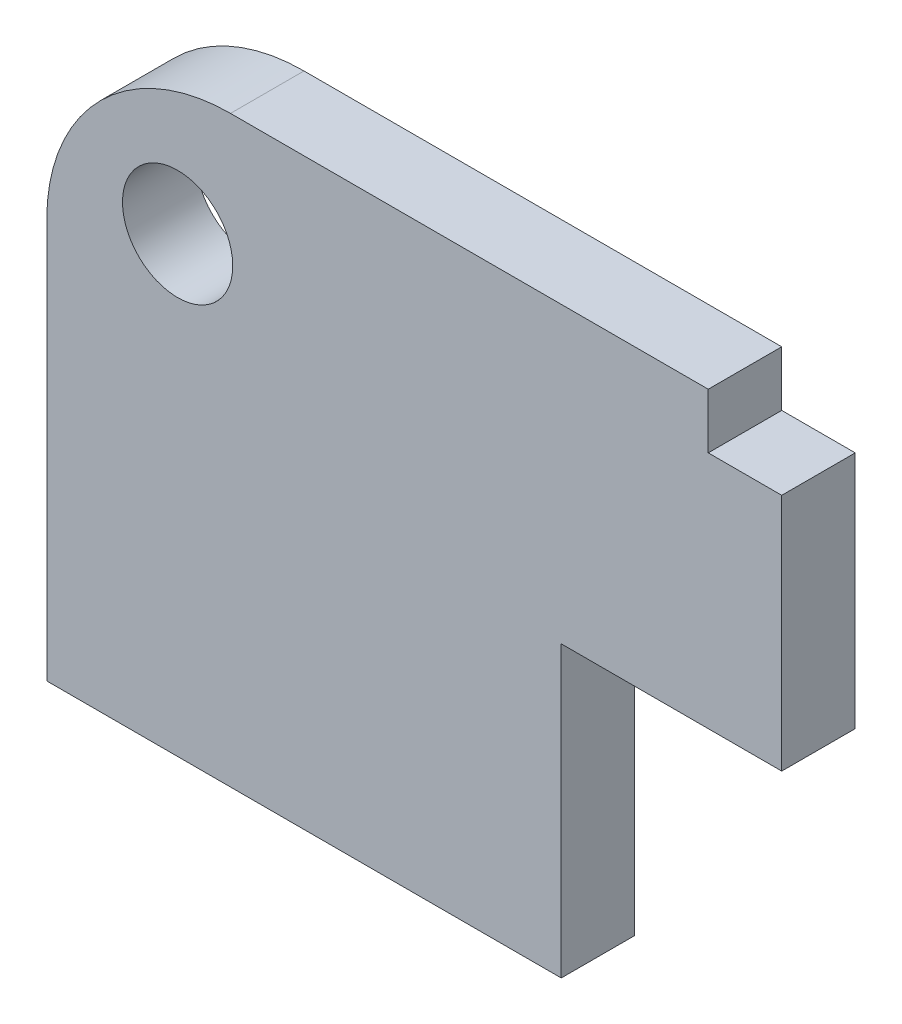
ISO-10303-21;
HEADER;
FILE_DESCRIPTION(('STEP AP214'),'2;1');
FILE_NAME('part.step','',(''),(''),'','','');
FILE_SCHEMA(('AUTOMOTIVE_DESIGN { 1 0 10303 214 1 1 1 1 }'));
ENDSEC;
DATA;
#1=APPLICATION_CONTEXT('core data for automotive mechanical design processes');
#2=APPLICATION_PROTOCOL_DEFINITION('international standard','automotive_design',2000,#1);
#3=PRODUCT_CONTEXT('',#1,'mechanical');
#4=PRODUCT('Part','Part','',(#3));
#5=PRODUCT_RELATED_PRODUCT_CATEGORY('part','',(#4));
#6=PRODUCT_DEFINITION_FORMATION('','',#4);
#7=PRODUCT_DEFINITION_CONTEXT('part definition',#1,'design');
#8=PRODUCT_DEFINITION('design','',#6,#7);
#9=PRODUCT_DEFINITION_SHAPE('','',#8);
#10=(LENGTH_UNIT() NAMED_UNIT(*) SI_UNIT(.MILLI.,.METRE.));
#11=(NAMED_UNIT(*) PLANE_ANGLE_UNIT() SI_UNIT($,.RADIAN.));
#12=(NAMED_UNIT(*) SI_UNIT($,.STERADIAN.) SOLID_ANGLE_UNIT());
#13=UNCERTAINTY_MEASURE_WITH_UNIT(LENGTH_MEASURE(1.E-05),#10,'distance_accuracy_value','');
#14=(GEOMETRIC_REPRESENTATION_CONTEXT(3) GLOBAL_UNCERTAINTY_ASSIGNED_CONTEXT((#13)) GLOBAL_UNIT_ASSIGNED_CONTEXT((#10,
#11,#12)) REPRESENTATION_CONTEXT('',''));
#15=CARTESIAN_POINT('',(0.,0.,0.));
#16=DIRECTION('',(0.,0.,1.));
#17=DIRECTION('',(1.,0.,0.));
#18=AXIS2_PLACEMENT_3D('',#15,#16,#17);
#19=CARTESIAN_POINT('',(5.,-5.,2.));
#20=DIRECTION('',(0.,0.,-1.));
#21=DIRECTION('',(-1.,0.,0.));
#22=AXIS2_PLACEMENT_3D('',#19,#20,#21);
#23=PLANE('',#22);
#24=CARTESIAN_POINT('',(5.,-5.,2.));
#25=DIRECTION('',(0.,0.,1.));
#26=DIRECTION('',(-1.,0.,0.));
#27=AXIS2_PLACEMENT_3D('',#24,#25,#26);
#28=CIRCLE('',#27,5.);
#29=CARTESIAN_POINT('',(5.00000000000004,0.,2.));
#30=VERTEX_POINT('',#29);
#31=CARTESIAN_POINT('',(0.,-5.00000000000004,2.));
#32=VERTEX_POINT('',#31);
#33=EDGE_CURVE('E153',#30,#32,#28,.T.);
#34=ORIENTED_EDGE('',*,*,#33,.T.);
#35=DIRECTION('',(0.,-1.,0.));
#36=VECTOR('',#35,1.);
#37=CARTESIAN_POINT('',(0.,-15.8756265982005,2.));
#38=LINE('',#37,#36);
#39=CARTESIAN_POINT('',(0.,-15.8756265982005,2.));
#40=VERTEX_POINT('',#39);
#41=EDGE_CURVE('E96',#32,#40,#38,.T.);
#42=ORIENTED_EDGE('',*,*,#41,.T.);
#43=DIRECTION('',(1.,0.,0.));
#44=VECTOR('',#43,1.);
#45=CARTESIAN_POINT('',(14.,-15.8756265982005,2.));
#46=LINE('',#45,#44);
#47=CARTESIAN_POINT('',(14.,-15.8756265982005,2.));
#48=VERTEX_POINT('',#47);
#49=EDGE_CURVE('E171',#40,#48,#46,.T.);
#50=ORIENTED_EDGE('',*,*,#49,.T.);
#51=DIRECTION('',(0.,1.,0.));
#52=VECTOR('',#51,1.);
#53=CARTESIAN_POINT('',(14.,-15.8756265982005,2.));
#54=LINE('',#53,#52);
#55=CARTESIAN_POINT('',(14.,-7.99999999999997,2.));
#56=VERTEX_POINT('',#55);
#57=EDGE_CURVE('E188',#48,#56,#54,.T.);
#58=ORIENTED_EDGE('',*,*,#57,.T.);
#59=DIRECTION('',(1.,0.,0.));
#60=VECTOR('',#59,1.);
#61=CARTESIAN_POINT('',(14.,-7.99999999999997,2.));
#62=LINE('',#61,#60);
#63=CARTESIAN_POINT('',(20.,-7.99999999999997,2.));
#64=VERTEX_POINT('',#63);
#65=EDGE_CURVE('E187',#56,#64,#62,.T.);
#66=ORIENTED_EDGE('',*,*,#65,.T.);
#67=DIRECTION('',(0.,1.,0.));
#68=VECTOR('',#67,1.);
#69=CARTESIAN_POINT('',(20.,-1.49999999999998,2.));
#70=LINE('',#69,#68);
#71=CARTESIAN_POINT('',(20.,-1.49999999999998,2.));
#72=VERTEX_POINT('',#71);
#73=EDGE_CURVE('E118',#64,#72,#70,.T.);
#74=ORIENTED_EDGE('',*,*,#73,.T.);
#75=DIRECTION('',(-1.,0.,0.));
#76=VECTOR('',#75,1.);
#77=CARTESIAN_POINT('',(20.,-1.49999999999998,2.));
#78=LINE('',#77,#76);
#79=CARTESIAN_POINT('',(18.,-1.49999999999998,2.));
#80=VERTEX_POINT('',#79);
#81=EDGE_CURVE('E112',#72,#80,#78,.T.);
#82=ORIENTED_EDGE('',*,*,#81,.T.);
#83=DIRECTION('',(0.,1.,0.));
#84=VECTOR('',#83,1.);
#85=CARTESIAN_POINT('',(18.,-1.49999999999998,2.));
#86=LINE('',#85,#84);
#87=CARTESIAN_POINT('',(18.,0.,2.));
#88=VERTEX_POINT('',#87);
#89=EDGE_CURVE('E116',#80,#88,#86,.T.);
#90=ORIENTED_EDGE('',*,*,#89,.T.);
#91=DIRECTION('',(-1.,0.,0.));
#92=VECTOR('',#91,1.);
#93=CARTESIAN_POINT('',(5.00000000000004,0.,2.));
#94=LINE('',#93,#92);
#95=EDGE_CURVE('E50',#88,#30,#94,.T.);
#96=ORIENTED_EDGE('',*,*,#95,.T.);
#97=EDGE_LOOP('',(#34,#42,#50,#58,#66,#74,#82,#90,#96));
#98=FACE_BOUND('',#97,.T.);
#99=CARTESIAN_POINT('',(3.56066017177984,-3.56066017177984,2.));
#100=DIRECTION('',(0.,0.,1.));
#101=DIRECTION('',(1.,0.,0.));
#102=AXIS2_PLACEMENT_3D('',#99,#100,#101);
#103=CIRCLE('',#102,1.5);
#104=CARTESIAN_POINT('',(5.06066017177984,-3.56066017177984,2.));
#105=VERTEX_POINT('',#104);
#106=EDGE_CURVE('E140',#105,#105,#103,.T.);
#107=ORIENTED_EDGE('',*,*,#106,.F.);
#108=EDGE_LOOP('',(#107));
#109=FACE_BOUND('',#108,.T.);
#110=ADVANCED_FACE('F33',(#98,#109),#23,.F.);
#111=CARTESIAN_POINT('',(5.,-5.,0.));
#112=DIRECTION('',(0.,0.,-1.));
#113=DIRECTION('',(-1.,0.,0.));
#114=AXIS2_PLACEMENT_3D('',#111,#112,#113);
#115=PLANE('',#114);
#116=CARTESIAN_POINT('',(5.,-5.,0.));
#117=DIRECTION('',(0.,0.,1.));
#118=DIRECTION('',(-1.,0.,0.));
#119=AXIS2_PLACEMENT_3D('',#116,#117,#118);
#120=CIRCLE('',#119,5.);
#121=CARTESIAN_POINT('',(5.00000000000004,0.,0.));
#122=VERTEX_POINT('',#121);
#123=CARTESIAN_POINT('',(0.,-5.00000000000004,0.));
#124=VERTEX_POINT('',#123);
#125=EDGE_CURVE('E136',#122,#124,#120,.T.);
#126=ORIENTED_EDGE('',*,*,#125,.F.);
#127=DIRECTION('',(-1.,0.,0.));
#128=VECTOR('',#127,1.);
#129=CARTESIAN_POINT('',(5.00000000000004,0.,0.));
#130=LINE('',#129,#128);
#131=CARTESIAN_POINT('',(18.,0.,0.));
#132=VERTEX_POINT('',#131);
#133=EDGE_CURVE('E88',#132,#122,#130,.T.);
#134=ORIENTED_EDGE('',*,*,#133,.F.);
#135=DIRECTION('',(0.,1.,0.));
#136=VECTOR('',#135,1.);
#137=CARTESIAN_POINT('',(18.,-1.49999999999998,0.));
#138=LINE('',#137,#136);
#139=CARTESIAN_POINT('',(18.,-1.49999999999998,0.));
#140=VERTEX_POINT('',#139);
#141=EDGE_CURVE('E82',#140,#132,#138,.T.);
#142=ORIENTED_EDGE('',*,*,#141,.F.);
#143=DIRECTION('',(-1.,0.,0.));
#144=VECTOR('',#143,1.);
#145=CARTESIAN_POINT('',(20.,-1.49999999999998,0.));
#146=LINE('',#145,#144);
#147=CARTESIAN_POINT('',(20.,-1.49999999999998,0.));
#148=VERTEX_POINT('',#147);
#149=EDGE_CURVE('E126',#148,#140,#146,.T.);
#150=ORIENTED_EDGE('',*,*,#149,.F.);
#151=DIRECTION('',(0.,1.,0.));
#152=VECTOR('',#151,1.);
#153=CARTESIAN_POINT('',(20.,-1.49999999999998,0.));
#154=LINE('',#153,#152);
#155=CARTESIAN_POINT('',(20.,-7.99999999999997,0.));
#156=VERTEX_POINT('',#155);
#157=EDGE_CURVE('E148',#156,#148,#154,.T.);
#158=ORIENTED_EDGE('',*,*,#157,.F.);
#159=DIRECTION('',(1.,0.,0.));
#160=VECTOR('',#159,1.);
#161=CARTESIAN_POINT('',(14.,-7.99999999999997,0.));
#162=LINE('',#161,#160);
#163=CARTESIAN_POINT('',(14.,-7.99999999999997,0.));
#164=VERTEX_POINT('',#163);
#165=EDGE_CURVE('E146',#164,#156,#162,.T.);
#166=ORIENTED_EDGE('',*,*,#165,.F.);
#167=DIRECTION('',(0.,1.,0.));
#168=VECTOR('',#167,1.);
#169=CARTESIAN_POINT('',(14.,-15.8756265982005,0.));
#170=LINE('',#169,#168);
#171=CARTESIAN_POINT('',(14.,-15.8756265982005,0.));
#172=VERTEX_POINT('',#171);
#173=EDGE_CURVE('E144',#172,#164,#170,.T.);
#174=ORIENTED_EDGE('',*,*,#173,.F.);
#175=DIRECTION('',(1.,0.,0.));
#176=VECTOR('',#175,1.);
#177=CARTESIAN_POINT('',(14.,-15.8756265982005,0.));
#178=LINE('',#177,#176);
#179=CARTESIAN_POINT('',(0.,-15.8756265982005,0.));
#180=VERTEX_POINT('',#179);
#181=EDGE_CURVE('E142',#180,#172,#178,.T.);
#182=ORIENTED_EDGE('',*,*,#181,.F.);
#183=DIRECTION('',(0.,-1.,0.));
#184=VECTOR('',#183,1.);
#185=CARTESIAN_POINT('',(0.,-15.8756265982005,0.));
#186=LINE('',#185,#184);
#187=EDGE_CURVE('E139',#124,#180,#186,.T.);
#188=ORIENTED_EDGE('',*,*,#187,.F.);
#189=EDGE_LOOP('',(#126,#134,#142,#150,#158,#166,#174,#182,#188));
#190=FACE_BOUND('',#189,.T.);
#191=CARTESIAN_POINT('',(3.56066017177984,-3.56066017177984,0.));
#192=DIRECTION('',(0.,0.,1.));
#193=DIRECTION('',(1.,0.,0.));
#194=AXIS2_PLACEMENT_3D('',#191,#192,#193);
#195=CIRCLE('',#194,1.5);
#196=CARTESIAN_POINT('',(5.06066017177984,-3.56066017177984,0.));
#197=VERTEX_POINT('',#196);
#198=EDGE_CURVE('E195',#197,#197,#195,.T.);
#199=ORIENTED_EDGE('',*,*,#198,.T.);
#200=EDGE_LOOP('',(#199));
#201=FACE_BOUND('',#200,.T.);
#202=ADVANCED_FACE('F175',(#190,#201),#115,.T.);
#203=CARTESIAN_POINT('',(5.,-5.,2.));
#204=DIRECTION('',(0.,0.,-1.));
#205=DIRECTION('',(-1.,0.,0.));
#206=AXIS2_PLACEMENT_3D('',#203,#204,#205);
#207=CYLINDRICAL_SURFACE('',#206,5.);
#208=ORIENTED_EDGE('',*,*,#125,.T.);
#209=DIRECTION('',(0.,0.,-1.));
#210=VECTOR('',#209,1.);
#211=CARTESIAN_POINT('',(0.,-5.00000000000004,2.));
#212=LINE('',#211,#210);
#213=EDGE_CURVE('E11',#32,#124,#212,.T.);
#214=ORIENTED_EDGE('',*,*,#213,.F.);
#215=ORIENTED_EDGE('',*,*,#33,.F.);
#216=DIRECTION('',(0.,0.,-1.));
#217=VECTOR('',#216,1.);
#218=CARTESIAN_POINT('',(5.00000000000004,0.,2.));
#219=LINE('',#218,#217);
#220=EDGE_CURVE('E132',#30,#122,#219,.T.);
#221=ORIENTED_EDGE('',*,*,#220,.T.);
#222=EDGE_LOOP('',(#208,#214,#215,#221));
#223=FACE_BOUND('',#222,.T.);
#224=ADVANCED_FACE('F35',(#223),#207,.T.);
#225=CARTESIAN_POINT('',(0.,-15.8756265982005,2.));
#226=DIRECTION('',(1.,0.,0.));
#227=DIRECTION('',(0.,0.,-1.));
#228=AXIS2_PLACEMENT_3D('',#225,#226,#227);
#229=PLANE('',#228);
#230=ORIENTED_EDGE('',*,*,#187,.T.);
#231=DIRECTION('',(0.,0.,-1.));
#232=VECTOR('',#231,1.);
#233=CARTESIAN_POINT('',(0.,-15.8756265982005,2.));
#234=LINE('',#233,#232);
#235=EDGE_CURVE('E42',#40,#180,#234,.T.);
#236=ORIENTED_EDGE('',*,*,#235,.F.);
#237=ORIENTED_EDGE('',*,*,#41,.F.);
#238=ORIENTED_EDGE('',*,*,#213,.T.);
#239=EDGE_LOOP('',(#230,#236,#237,#238));
#240=FACE_BOUND('',#239,.T.);
#241=ADVANCED_FACE('F227',(#240),#229,.F.);
#242=CARTESIAN_POINT('',(14.,-15.8756265982005,2.));
#243=DIRECTION('',(0.,1.,0.));
#244=DIRECTION('',(0.,0.,1.));
#245=AXIS2_PLACEMENT_3D('',#242,#243,#244);
#246=PLANE('',#245);
#247=ORIENTED_EDGE('',*,*,#181,.T.);
#248=DIRECTION('',(0.,0.,-1.));
#249=VECTOR('',#248,1.);
#250=CARTESIAN_POINT('',(14.,-15.8756265982005,2.));
#251=LINE('',#250,#249);
#252=EDGE_CURVE('E163',#48,#172,#251,.T.);
#253=ORIENTED_EDGE('',*,*,#252,.F.);
#254=ORIENTED_EDGE('',*,*,#49,.F.);
#255=ORIENTED_EDGE('',*,*,#235,.T.);
#256=EDGE_LOOP('',(#247,#253,#254,#255));
#257=FACE_BOUND('',#256,.T.);
#258=ADVANCED_FACE('F169',(#257),#246,.F.);
#259=CARTESIAN_POINT('',(14.,-15.8756265982005,2.));
#260=DIRECTION('',(-1.,0.,0.));
#261=DIRECTION('',(0.,0.,1.));
#262=AXIS2_PLACEMENT_3D('',#259,#260,#261);
#263=PLANE('',#262);
#264=ORIENTED_EDGE('',*,*,#173,.T.);
#265=DIRECTION('',(0.,0.,-1.));
#266=VECTOR('',#265,1.);
#267=CARTESIAN_POINT('',(14.,-7.99999999999997,2.));
#268=LINE('',#267,#266);
#269=EDGE_CURVE('E160',#56,#164,#268,.T.);
#270=ORIENTED_EDGE('',*,*,#269,.F.);
#271=ORIENTED_EDGE('',*,*,#57,.F.);
#272=ORIENTED_EDGE('',*,*,#252,.T.);
#273=EDGE_LOOP('',(#264,#270,#271,#272));
#274=FACE_BOUND('',#273,.T.);
#275=ADVANCED_FACE('F181',(#274),#263,.F.);
#276=CARTESIAN_POINT('',(14.,-7.99999999999997,2.));
#277=DIRECTION('',(0.,1.,0.));
#278=DIRECTION('',(0.,0.,1.));
#279=AXIS2_PLACEMENT_3D('',#276,#277,#278);
#280=PLANE('',#279);
#281=ORIENTED_EDGE('',*,*,#165,.T.);
#282=DIRECTION('',(0.,0.,-1.));
#283=VECTOR('',#282,1.);
#284=CARTESIAN_POINT('',(20.,-7.99999999999997,2.));
#285=LINE('',#284,#283);
#286=EDGE_CURVE('E157',#64,#156,#285,.T.);
#287=ORIENTED_EDGE('',*,*,#286,.F.);
#288=ORIENTED_EDGE('',*,*,#65,.F.);
#289=ORIENTED_EDGE('',*,*,#269,.T.);
#290=EDGE_LOOP('',(#281,#287,#288,#289));
#291=FACE_BOUND('',#290,.T.);
#292=ADVANCED_FACE('F185',(#291),#280,.F.);
#293=CARTESIAN_POINT('',(20.,-1.49999999999998,2.));
#294=DIRECTION('',(-1.,0.,0.));
#295=DIRECTION('',(0.,0.,1.));
#296=AXIS2_PLACEMENT_3D('',#293,#294,#295);
#297=PLANE('',#296);
#298=ORIENTED_EDGE('',*,*,#157,.T.);
#299=DIRECTION('',(0.,0.,-1.));
#300=VECTOR('',#299,1.);
#301=CARTESIAN_POINT('',(20.,-1.49999999999998,2.));
#302=LINE('',#301,#300);
#303=EDGE_CURVE('E127',#72,#148,#302,.T.);
#304=ORIENTED_EDGE('',*,*,#303,.F.);
#305=ORIENTED_EDGE('',*,*,#73,.F.);
#306=ORIENTED_EDGE('',*,*,#286,.T.);
#307=EDGE_LOOP('',(#298,#304,#305,#306));
#308=FACE_BOUND('',#307,.T.);
#309=ADVANCED_FACE('F218',(#308),#297,.F.);
#310=CARTESIAN_POINT('',(20.,-1.49999999999998,2.));
#311=DIRECTION('',(0.,-1.,0.));
#312=DIRECTION('',(1.,0.,0.));
#313=AXIS2_PLACEMENT_3D('',#310,#311,#312);
#314=PLANE('',#313);
#315=ORIENTED_EDGE('',*,*,#149,.T.);
#316=DIRECTION('',(0.,0.,-1.));
#317=VECTOR('',#316,1.);
#318=CARTESIAN_POINT('',(18.,-1.49999999999998,2.));
#319=LINE('',#318,#317);
#320=EDGE_CURVE('E123',#80,#140,#319,.T.);
#321=ORIENTED_EDGE('',*,*,#320,.F.);
#322=ORIENTED_EDGE('',*,*,#81,.F.);
#323=ORIENTED_EDGE('',*,*,#303,.T.);
#324=EDGE_LOOP('',(#315,#321,#322,#323));
#325=FACE_BOUND('',#324,.T.);
#326=ADVANCED_FACE('F124',(#325),#314,.F.);
#327=CARTESIAN_POINT('',(18.,-1.49999999999998,2.));
#328=DIRECTION('',(-1.,0.,0.));
#329=DIRECTION('',(0.,0.,1.));
#330=AXIS2_PLACEMENT_3D('',#327,#328,#329);
#331=PLANE('',#330);
#332=ORIENTED_EDGE('',*,*,#141,.T.);
#333=DIRECTION('',(0.,0.,-1.));
#334=VECTOR('',#333,1.);
#335=CARTESIAN_POINT('',(18.,0.,2.));
#336=LINE('',#335,#334);
#337=EDGE_CURVE('E128',#88,#132,#336,.T.);
#338=ORIENTED_EDGE('',*,*,#337,.F.);
#339=ORIENTED_EDGE('',*,*,#89,.F.);
#340=ORIENTED_EDGE('',*,*,#320,.T.);
#341=EDGE_LOOP('',(#332,#338,#339,#340));
#342=FACE_BOUND('',#341,.T.);
#343=ADVANCED_FACE('F130',(#342),#331,.F.);
#344=CARTESIAN_POINT('',(5.00000000000004,0.,2.));
#345=DIRECTION('',(0.,-1.,0.));
#346=DIRECTION('',(0.,0.,-1.));
#347=AXIS2_PLACEMENT_3D('',#344,#345,#346);
#348=PLANE('',#347);
#349=ORIENTED_EDGE('',*,*,#133,.T.);
#350=ORIENTED_EDGE('',*,*,#220,.F.);
#351=ORIENTED_EDGE('',*,*,#95,.F.);
#352=ORIENTED_EDGE('',*,*,#337,.T.);
#353=EDGE_LOOP('',(#349,#350,#351,#352));
#354=FACE_BOUND('',#353,.T.);
#355=ADVANCED_FACE('F211',(#354),#348,.F.);
#356=CARTESIAN_POINT('',(3.56066017177984,-3.56066017177984,2.));
#357=DIRECTION('',(0.,0.,-1.));
#358=DIRECTION('',(-1.,0.,0.));
#359=AXIS2_PLACEMENT_3D('',#356,#357,#358);
#360=CYLINDRICAL_SURFACE('',#359,1.5);
#361=ORIENTED_EDGE('',*,*,#106,.T.);
#362=EDGE_LOOP('',(#361));
#363=FACE_BOUND('',#362,.T.);
#364=ORIENTED_EDGE('',*,*,#198,.F.);
#365=EDGE_LOOP('',(#364));
#366=FACE_BOUND('',#365,.T.);
#367=ADVANCED_FACE('F201',(#363,#366),#360,.F.);
#368=CLOSED_SHELL('',(#110,#202,#224,#241,#258,#275,#292,#309,#326,#343,#355,#367));
#369=MANIFOLD_SOLID_BREP('B2',#368);
#370=ADVANCED_BREP_SHAPE_REPRESENTATION('',(#18,#369),#14);
#371=SHAPE_DEFINITION_REPRESENTATION(#9,#370);
ENDSEC;
END-ISO-10303-21;
